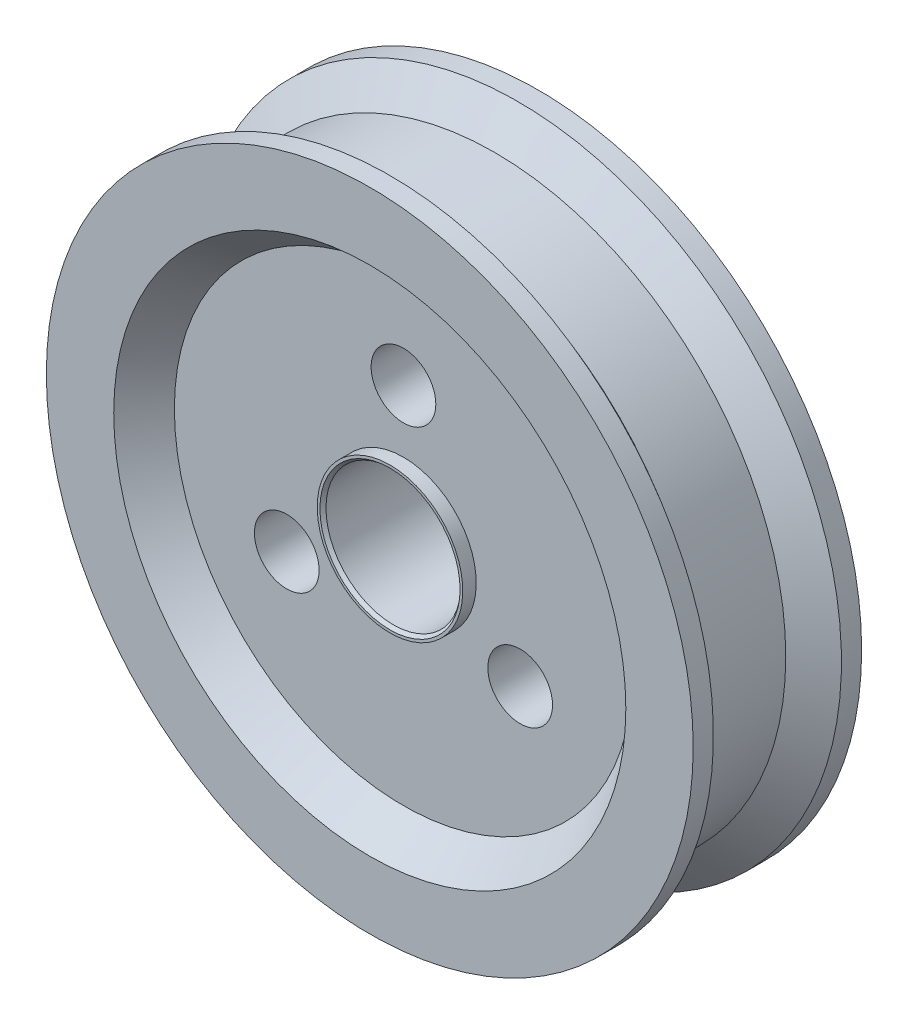
ISO-10303-21;
HEADER;
FILE_DESCRIPTION(('STEP AP214'),'2;1');
FILE_NAME('part.step','',(''),(''),'','','');
FILE_SCHEMA(('AUTOMOTIVE_DESIGN { 1 0 10303 214 1 1 1 1 }'));
ENDSEC;
DATA;
#1=APPLICATION_CONTEXT('core data for automotive mechanical design processes');
#2=APPLICATION_PROTOCOL_DEFINITION('international standard','automotive_design',2000,#1);
#3=PRODUCT_CONTEXT('',#1,'mechanical');
#4=PRODUCT('Part','Part','',(#3));
#5=PRODUCT_RELATED_PRODUCT_CATEGORY('part','',(#4));
#6=PRODUCT_DEFINITION_FORMATION('','',#4);
#7=PRODUCT_DEFINITION_CONTEXT('part definition',#1,'design');
#8=PRODUCT_DEFINITION('design','',#6,#7);
#9=PRODUCT_DEFINITION_SHAPE('','',#8);
#10=(LENGTH_UNIT() NAMED_UNIT(*) SI_UNIT(.MILLI.,.METRE.));
#11=(NAMED_UNIT(*) PLANE_ANGLE_UNIT() SI_UNIT($,.RADIAN.));
#12=(NAMED_UNIT(*) SI_UNIT($,.STERADIAN.) SOLID_ANGLE_UNIT());
#13=UNCERTAINTY_MEASURE_WITH_UNIT(LENGTH_MEASURE(1.E-05),#10,'distance_accuracy_value','');
#14=(GEOMETRIC_REPRESENTATION_CONTEXT(3) GLOBAL_UNCERTAINTY_ASSIGNED_CONTEXT((#13)) GLOBAL_UNIT_ASSIGNED_CONTEXT((#10,
#11,#12)) REPRESENTATION_CONTEXT('',''));
#15=CARTESIAN_POINT('',(0.,0.,0.));
#16=DIRECTION('',(0.,0.,1.));
#17=DIRECTION('',(1.,0.,0.));
#18=AXIS2_PLACEMENT_3D('',#15,#16,#17);
#19=CARTESIAN_POINT('',(0.,0.,9.8950000002415));
#20=DIRECTION('',(0.,0.,-1.));
#21=DIRECTION('',(-1.,0.,0.));
#22=AXIS2_PLACEMENT_3D('',#19,#20,#21);
#23=CYLINDRICAL_SURFACE('',#22,37.9992);
#24=CARTESIAN_POINT('',(0.,0.,-9.8950000002415));
#25=DIRECTION('',(0.,0.,1.));
#26=DIRECTION('',(1.,0.,0.));
#27=AXIS2_PLACEMENT_3D('',#24,#25,#26);
#28=CIRCLE('',#27,37.9992);
#29=CARTESIAN_POINT('',(37.9992,0.,-9.8950000002415));
#30=VERTEX_POINT('',#29);
#31=EDGE_CURVE('E88',#30,#30,#28,.T.);
#32=ORIENTED_EDGE('',*,*,#31,.T.);
#33=EDGE_LOOP('',(#32));
#34=FACE_BOUND('',#33,.T.);
#35=CARTESIAN_POINT('',(0.,0.,-7.52020000018356));
#36=DIRECTION('',(0.,0.,-1.));
#37=DIRECTION('',(-1.,0.,0.));
#38=AXIS2_PLACEMENT_3D('',#35,#36,#37);
#39=CIRCLE('',#38,37.9992);
#40=CARTESIAN_POINT('',(-37.9992,0.,-7.52020000018356));
#41=VERTEX_POINT('',#40);
#42=EDGE_CURVE('E99',#41,#41,#39,.T.);
#43=ORIENTED_EDGE('',*,*,#42,.T.);
#44=EDGE_LOOP('',(#43));
#45=FACE_BOUND('',#44,.T.);
#46=ADVANCED_FACE('F45',(#34,#45),#23,.T.);
#47=CARTESIAN_POINT('',(0.,0.,9.8950000002415));
#48=DIRECTION('',(0.,0.,1.));
#49=DIRECTION('',(1.,0.,0.));
#50=AXIS2_PLACEMENT_3D('',#47,#48,#49);
#51=CIRCLE('',#50,37.9992);
#52=CARTESIAN_POINT('',(37.9992,0.,9.8950000002415));
#53=VERTEX_POINT('',#52);
#54=EDGE_CURVE('E83',#53,#53,#51,.T.);
#55=ORIENTED_EDGE('',*,*,#54,.F.);
#56=EDGE_LOOP('',(#55));
#57=FACE_BOUND('',#56,.T.);
#58=CARTESIAN_POINT('',(0.,0.,7.52020000018354));
#59=DIRECTION('',(0.,0.,-1.));
#60=DIRECTION('',(-1.,0.,0.));
#61=AXIS2_PLACEMENT_3D('',#58,#59,#60);
#62=CIRCLE('',#61,37.9992);
#63=CARTESIAN_POINT('',(-37.9992,0.,7.52020000018354));
#64=VERTEX_POINT('',#63);
#65=EDGE_CURVE('E89',#64,#64,#62,.T.);
#66=ORIENTED_EDGE('',*,*,#65,.F.);
#67=EDGE_LOOP('',(#66));
#68=FACE_BOUND('',#67,.T.);
#69=ADVANCED_FACE('F168',(#57,#68),#23,.T.);
#70=CARTESIAN_POINT('',(0.,0.,9.8950000002415));
#71=DIRECTION('',(0.,0.,1.));
#72=DIRECTION('',(1.,0.,0.));
#73=AXIS2_PLACEMENT_3D('',#70,#71,#72);
#74=PLANE('',#73);
#75=CARTESIAN_POINT('',(0.,0.,9.8950000002415));
#76=DIRECTION('',(0.,0.,-1.));
#77=DIRECTION('',(-1.,0.,0.));
#78=AXIS2_PLACEMENT_3D('',#75,#76,#77);
#79=CIRCLE('',#78,30.0827);
#80=CARTESIAN_POINT('',(-30.0827,0.,9.8950000002415));
#81=VERTEX_POINT('',#80);
#82=EDGE_CURVE('E78',#81,#81,#79,.T.);
#83=ORIENTED_EDGE('',*,*,#82,.T.);
#84=EDGE_LOOP('',(#83));
#85=FACE_BOUND('',#84,.T.);
#86=ORIENTED_EDGE('',*,*,#54,.T.);
#87=EDGE_LOOP('',(#86));
#88=FACE_BOUND('',#87,.T.);
#89=ADVANCED_FACE('F158',(#85,#88),#74,.T.);
#90=CARTESIAN_POINT('',(0.,0.,-9.8950000002415));
#91=DIRECTION('',(0.,0.,1.));
#92=DIRECTION('',(1.,0.,0.));
#93=AXIS2_PLACEMENT_3D('',#90,#91,#92);
#94=PLANE('',#93);
#95=CARTESIAN_POINT('',(0.,0.,-9.8950000002415));
#96=DIRECTION('',(0.,0.,1.));
#97=DIRECTION('',(1.,0.,0.));
#98=AXIS2_PLACEMENT_3D('',#95,#96,#97);
#99=CIRCLE('',#98,30.0827);
#100=CARTESIAN_POINT('',(30.0827,0.,-9.8950000002415));
#101=VERTEX_POINT('',#100);
#102=EDGE_CURVE('E70',#101,#101,#99,.T.);
#103=ORIENTED_EDGE('',*,*,#102,.T.);
#104=EDGE_LOOP('',(#103));
#105=FACE_BOUND('',#104,.T.);
#106=ORIENTED_EDGE('',*,*,#31,.F.);
#107=EDGE_LOOP('',(#106));
#108=FACE_BOUND('',#107,.T.);
#109=ADVANCED_FACE('F155',(#105,#108),#94,.F.);
#110=CARTESIAN_POINT('',(0.,0.,5.9370000001449));
#111=DIRECTION('',(0.,0.,1.));
#112=DIRECTION('',(1.,0.,0.));
#113=AXIS2_PLACEMENT_3D('',#110,#111,#112);
#114=PLANE('',#113);
#115=CARTESIAN_POINT('',(0.,0.,5.9370000001449));
#116=DIRECTION('',(0.,0.,1.));
#117=DIRECTION('',(1.,0.,0.));
#118=AXIS2_PLACEMENT_3D('',#115,#116,#117);
#119=CIRCLE('',#118,8.54982);
#120=CARTESIAN_POINT('',(0.,8.54982,5.9370000001449));
#121=VERTEX_POINT('',#120);
#122=EDGE_CURVE('E82',#121,#121,#119,.T.);
#123=ORIENTED_EDGE('',*,*,#122,.F.);
#124=EDGE_LOOP('',(#123));
#125=FACE_BOUND('',#124,.T.);
#126=CARTESIAN_POINT('',(0.,15.833,5.9370000001449));
#127=DIRECTION('',(0.,0.,1.));
#128=DIRECTION('',(1.,0.,0.));
#129=AXIS2_PLACEMENT_3D('',#126,#127,#128);
#130=CIRCLE('',#129,3.79992);
#131=CARTESIAN_POINT('',(3.79992,15.833,5.9370000001449));
#132=VERTEX_POINT('',#131);
#133=EDGE_CURVE('E136',#132,#132,#130,.T.);
#134=ORIENTED_EDGE('',*,*,#133,.F.);
#135=EDGE_LOOP('',(#134));
#136=FACE_BOUND('',#135,.T.);
#137=CARTESIAN_POINT('',(13.711780218119,-7.91649999999903,5.9370000001449));
#138=DIRECTION('',(0.,0.,1.));
#139=DIRECTION('',(1.,0.,0.));
#140=AXIS2_PLACEMENT_3D('',#137,#138,#139);
#141=CIRCLE('',#140,3.79992000000102);
#142=CARTESIAN_POINT('',(17.51170021812,-7.91649999999903,5.9370000001449));
#143=VERTEX_POINT('',#142);
#144=EDGE_CURVE('E110',#143,#143,#141,.T.);
#145=ORIENTED_EDGE('',*,*,#144,.F.);
#146=EDGE_LOOP('',(#145));
#147=FACE_BOUND('',#146,.T.);
#148=CARTESIAN_POINT('',(-13.7117802181182,-7.91649999999951,5.9370000001449));
#149=DIRECTION('',(0.,0.,1.));
#150=DIRECTION('',(1.,0.,0.));
#151=AXIS2_PLACEMENT_3D('',#148,#149,#150);
#152=CIRCLE('',#151,3.79992000000043);
#153=CARTESIAN_POINT('',(-9.91186021811775,-7.91649999999951,5.9370000001449));
#154=VERTEX_POINT('',#153);
#155=EDGE_CURVE('E104',#154,#154,#152,.T.);
#156=ORIENTED_EDGE('',*,*,#155,.F.);
#157=EDGE_LOOP('',(#156));
#158=FACE_BOUND('',#157,.T.);
#159=CARTESIAN_POINT('',(0.,0.,5.9370000001449));
#160=DIRECTION('',(0.,0.,1.));
#161=DIRECTION('',(1.,0.,0.));
#162=AXIS2_PLACEMENT_3D('',#159,#160,#161);
#163=CIRCLE('',#162,26.9161);
#164=CARTESIAN_POINT('',(26.9161,0.,5.9370000001449));
#165=VERTEX_POINT('',#164);
#166=EDGE_CURVE('E121',#165,#165,#163,.T.);
#167=ORIENTED_EDGE('',*,*,#166,.T.);
#168=EDGE_LOOP('',(#167));
#169=FACE_BOUND('',#168,.T.);
#170=ADVANCED_FACE('F157',(#125,#136,#147,#158,#169),#114,.T.);
#171=CARTESIAN_POINT('',(0.,0.,-5.9370000001449));
#172=DIRECTION('',(0.,0.,-1.));
#173=DIRECTION('',(1.,0.,0.));
#174=AXIS2_PLACEMENT_3D('',#171,#172,#173);
#175=PLANE('',#174);
#176=CARTESIAN_POINT('',(0.,0.,-5.9370000001449));
#177=DIRECTION('',(0.,0.,-1.));
#178=DIRECTION('',(-1.,0.,0.));
#179=AXIS2_PLACEMENT_3D('',#176,#177,#178);
#180=CIRCLE('',#179,8.54982);
#181=CARTESIAN_POINT('',(0.,8.54982,-5.9370000001449));
#182=VERTEX_POINT('',#181);
#183=EDGE_CURVE('E87',#182,#182,#180,.T.);
#184=ORIENTED_EDGE('',*,*,#183,.F.);
#185=EDGE_LOOP('',(#184));
#186=FACE_BOUND('',#185,.T.);
#187=CARTESIAN_POINT('',(0.,15.833,-5.9370000001449));
#188=DIRECTION('',(0.,0.,-1.));
#189=DIRECTION('',(-1.,0.,0.));
#190=AXIS2_PLACEMENT_3D('',#187,#188,#189);
#191=CIRCLE('',#190,3.79992);
#192=CARTESIAN_POINT('',(3.79992,15.833,-5.9370000001449));
#193=VERTEX_POINT('',#192);
#194=EDGE_CURVE('E122',#193,#193,#191,.T.);
#195=ORIENTED_EDGE('',*,*,#194,.F.);
#196=EDGE_LOOP('',(#195));
#197=FACE_BOUND('',#196,.T.);
#198=CARTESIAN_POINT('',(13.711780218119,-7.91649999999903,-5.9370000001449));
#199=DIRECTION('',(0.,0.,-1.));
#200=DIRECTION('',(-1.,0.,0.));
#201=AXIS2_PLACEMENT_3D('',#198,#199,#200);
#202=CIRCLE('',#201,3.79992000000102);
#203=CARTESIAN_POINT('',(17.51170021812,-7.91649999999903,-5.9370000001449));
#204=VERTEX_POINT('',#203);
#205=EDGE_CURVE('E129',#204,#204,#202,.T.);
#206=ORIENTED_EDGE('',*,*,#205,.F.);
#207=EDGE_LOOP('',(#206));
#208=FACE_BOUND('',#207,.T.);
#209=CARTESIAN_POINT('',(-13.7117802181182,-7.91649999999951,-5.9370000001449));
#210=DIRECTION('',(0.,0.,-1.));
#211=DIRECTION('',(-1.,0.,0.));
#212=AXIS2_PLACEMENT_3D('',#209,#210,#211);
#213=CIRCLE('',#212,3.79992000000043);
#214=CARTESIAN_POINT('',(-17.5117002181186,-7.91649999999951,-5.9370000001449));
#215=VERTEX_POINT('',#214);
#216=EDGE_CURVE('E133',#215,#215,#213,.T.);
#217=ORIENTED_EDGE('',*,*,#216,.F.);
#218=EDGE_LOOP('',(#217));
#219=FACE_BOUND('',#218,.T.);
#220=CARTESIAN_POINT('',(0.,0.,-5.9370000001449));
#221=DIRECTION('',(0.,0.,1.));
#222=DIRECTION('',(1.,0.,0.));
#223=AXIS2_PLACEMENT_3D('',#220,#221,#222);
#224=CIRCLE('',#223,26.9161);
#225=CARTESIAN_POINT('',(26.9161,0.,-5.9370000001449));
#226=VERTEX_POINT('',#225);
#227=EDGE_CURVE('E117',#226,#226,#224,.T.);
#228=ORIENTED_EDGE('',*,*,#227,.F.);
#229=EDGE_LOOP('',(#228));
#230=FACE_BOUND('',#229,.T.);
#231=ADVANCED_FACE('F165',(#186,#197,#208,#219,#230),#175,.T.);
#232=CARTESIAN_POINT('',(-13.7117802181182,-7.91649999999951,-9.8950000002415));
#233=DIRECTION('',(0.,0.,1.));
#234=DIRECTION('',(1.,0.,0.));
#235=AXIS2_PLACEMENT_3D('',#232,#233,#234);
#236=CYLINDRICAL_SURFACE('',#235,3.79992000000043);
#237=ORIENTED_EDGE('',*,*,#216,.T.);
#238=EDGE_LOOP('',(#237));
#239=FACE_BOUND('',#238,.T.);
#240=ORIENTED_EDGE('',*,*,#155,.T.);
#241=EDGE_LOOP('',(#240));
#242=FACE_BOUND('',#241,.T.);
#243=ADVANCED_FACE('F324',(#239,#242),#236,.F.);
#244=CARTESIAN_POINT('',(13.711780218119,-7.91649999999903,-9.8950000002415));
#245=DIRECTION('',(0.,0.,1.));
#246=DIRECTION('',(1.,0.,0.));
#247=AXIS2_PLACEMENT_3D('',#244,#245,#246);
#248=CYLINDRICAL_SURFACE('',#247,3.79992000000102);
#249=CARTESIAN_POINT('',(17.51170021812,-7.91649999999903,-5.9370000001449));
#250=CARTESIAN_POINT('',(17.51170021812,-7.91649999999903,-5.81331250014188));
#251=CARTESIAN_POINT('',(17.51170021812,-7.91649999999903,-5.68962500013886));
#252=CARTESIAN_POINT('',(17.51170021812,-7.91649999999903,-5.44225000013282));
#253=CARTESIAN_POINT('',(17.51170021812,-7.91649999999903,-5.31856250012981));
#254=CARTESIAN_POINT('',(17.51170021812,-7.91649999999903,-5.07118750012377));
#255=CARTESIAN_POINT('',(17.51170021812,-7.91649999999903,-4.94750000012075));
#256=CARTESIAN_POINT('',(17.51170021812,-7.91649999999903,-4.70012500011471));
#257=CARTESIAN_POINT('',(17.51170021812,-7.91649999999903,-4.57643750011169));
#258=CARTESIAN_POINT('',(17.51170021812,-7.91649999999903,-4.32906250010566));
#259=CARTESIAN_POINT('',(17.51170021812,-7.91649999999903,-4.20537500010264));
#260=CARTESIAN_POINT('',(17.51170021812,-7.91649999999903,-3.9580000000966));
#261=CARTESIAN_POINT('',(17.51170021812,-7.91649999999903,-3.83431250009358));
#262=CARTESIAN_POINT('',(17.51170021812,-7.91649999999903,-3.58693750008754));
#263=CARTESIAN_POINT('',(17.51170021812,-7.91649999999903,-3.46325000008452));
#264=CARTESIAN_POINT('',(17.51170021812,-7.91649999999903,-3.21587500007849));
#265=CARTESIAN_POINT('',(17.51170021812,-7.91649999999903,-3.09218750007547));
#266=CARTESIAN_POINT('',(17.51170021812,-7.91649999999903,-2.84481250006943));
#267=CARTESIAN_POINT('',(17.51170021812,-7.91649999999903,-2.72112500006641));
#268=CARTESIAN_POINT('',(17.51170021812,-7.91649999999903,-2.47375000006037));
#269=CARTESIAN_POINT('',(17.51170021812,-7.91649999999903,-2.35006250005736));
#270=CARTESIAN_POINT('',(17.51170021812,-7.91649999999903,-2.10268750005132));
#271=CARTESIAN_POINT('',(17.51170021812,-7.91649999999903,-1.9790000000483));
#272=CARTESIAN_POINT('',(17.51170021812,-7.91649999999903,-1.73162500004226));
#273=CARTESIAN_POINT('',(17.51170021812,-7.91649999999903,-1.60793750003924));
#274=CARTESIAN_POINT('',(17.51170021812,-7.91649999999903,-1.36056250003321));
#275=CARTESIAN_POINT('',(17.51170021812,-7.91649999999903,-1.23687500003019));
#276=CARTESIAN_POINT('',(17.51170021812,-7.91649999999903,-0.98950000002415));
#277=CARTESIAN_POINT('',(17.51170021812,-7.91649999999903,-0.865812500021131));
#278=CARTESIAN_POINT('',(17.51170021812,-7.91649999999903,-0.618437500015093));
#279=CARTESIAN_POINT('',(17.51170021812,-7.91649999999903,-0.494750000012074));
#280=CARTESIAN_POINT('',(17.51170021812,-7.91649999999903,-0.247375000006037));
#281=CARTESIAN_POINT('',(17.51170021812,-7.91649999999903,-0.123687500003018));
#282=CARTESIAN_POINT('',(17.51170021812,-7.91649999999903,0.123687500003018));
#283=CARTESIAN_POINT('',(17.51170021812,-7.91649999999903,0.247375000006037));
#284=CARTESIAN_POINT('',(17.51170021812,-7.91649999999903,0.494750000012074));
#285=CARTESIAN_POINT('',(17.51170021812,-7.91649999999903,0.618437500015093));
#286=CARTESIAN_POINT('',(17.51170021812,-7.91649999999903,0.865812500021131));
#287=CARTESIAN_POINT('',(17.51170021812,-7.91649999999903,0.98950000002415));
#288=CARTESIAN_POINT('',(17.51170021812,-7.91649999999903,1.23687500003019));
#289=CARTESIAN_POINT('',(17.51170021812,-7.91649999999903,1.36056250003321));
#290=CARTESIAN_POINT('',(17.51170021812,-7.91649999999903,1.60793750003924));
#291=CARTESIAN_POINT('',(17.51170021812,-7.91649999999903,1.73162500004226));
#292=CARTESIAN_POINT('',(17.51170021812,-7.91649999999903,1.9790000000483));
#293=CARTESIAN_POINT('',(17.51170021812,-7.91649999999903,2.10268750005132));
#294=CARTESIAN_POINT('',(17.51170021812,-7.91649999999903,2.35006250005736));
#295=CARTESIAN_POINT('',(17.51170021812,-7.91649999999903,2.47375000006038));
#296=CARTESIAN_POINT('',(17.51170021812,-7.91649999999903,2.72112500006641));
#297=CARTESIAN_POINT('',(17.51170021812,-7.91649999999903,2.84481250006943));
#298=CARTESIAN_POINT('',(17.51170021812,-7.91649999999903,3.09218750007547));
#299=CARTESIAN_POINT('',(17.51170021812,-7.91649999999903,3.21587500007849));
#300=CARTESIAN_POINT('',(17.51170021812,-7.91649999999903,3.46325000008453));
#301=CARTESIAN_POINT('',(17.51170021812,-7.91649999999903,3.58693750008754));
#302=CARTESIAN_POINT('',(17.51170021812,-7.91649999999903,3.83431250009358));
#303=CARTESIAN_POINT('',(17.51170021812,-7.91649999999903,3.9580000000966));
#304=CARTESIAN_POINT('',(17.51170021812,-7.91649999999903,4.20537500010264));
#305=CARTESIAN_POINT('',(17.51170021812,-7.91649999999903,4.32906250010566));
#306=CARTESIAN_POINT('',(17.51170021812,-7.91649999999903,4.57643750011169));
#307=CARTESIAN_POINT('',(17.51170021812,-7.91649999999903,4.70012500011471));
#308=CARTESIAN_POINT('',(17.51170021812,-7.91649999999903,4.94750000012075));
#309=CARTESIAN_POINT('',(17.51170021812,-7.91649999999903,5.07118750012377));
#310=CARTESIAN_POINT('',(17.51170021812,-7.91649999999903,5.31856250012981));
#311=CARTESIAN_POINT('',(17.51170021812,-7.91649999999903,5.44225000013283));
#312=CARTESIAN_POINT('',(17.51170021812,-7.91649999999903,5.68962500013886));
#313=CARTESIAN_POINT('',(17.51170021812,-7.91649999999903,5.81331250014188));
#314=CARTESIAN_POINT('',(17.51170021812,-7.91649999999903,5.9370000001449));
#315=B_SPLINE_CURVE_WITH_KNOTS('',3,(#249,#250,#251,#252,#253,#254,#255,#256,#257,#258,#259,
#260,#261,#262,#263,#264,#265,#266,#267,#268,#269,#270,#271,#272,#273,#274,#275,#276,#277,#278,
#279,#280,#281,#282,#283,#284,#285,#286,#287,#288,#289,#290,#291,#292,#293,#294,#295,#296,#297,
#298,#299,#300,#301,#302,#303,#304,#305,#306,#307,#308,#309,#310,#311,#312,#313,#314),
.UNSPECIFIED.,.F.,.F.,(4,2,2,2,2,2,2,2,2,2,2,2,2,2,2,2,2,2,2,2,2,2,2,2,2,2,2,2,2,2,2,2,4),(0.,
0.371062500009056,0.742125000018113,1.11318750002717,1.48425000003623,1.85531250004528,
2.22637500005434,2.59743750006339,2.96850000007245,3.33956250008151,3.71062500009056,
4.08168750009962,4.45275000010867,4.82381250011773,5.19487500012679,5.56593750013584,
5.9370000001449,6.30806250015396,6.67912500016301,7.05018750017207,7.42125000018113,
7.79231250019018,8.16337500019924,8.53443750020829,8.90550000021735,9.27656250022641,
9.64762500023546,10.0186875002445,10.3897500002536,10.7608125002626,11.1318750002717,
11.5029375002807,11.8740000002898),.UNSPECIFIED.);
#316=EDGE_CURVE('BSEAM313',#204,#143,#315,.T.);
#317=ORIENTED_EDGE('',*,*,#205,.T.);
#318=ORIENTED_EDGE('',*,*,#144,.T.);
#319=ORIENTED_EDGE('',*,*,#316,.T.);
#320=ORIENTED_EDGE('',*,*,#316,.F.);
#321=EDGE_LOOP('',(#317,#319,#318,#320));
#322=FACE_BOUND('',#321,.T.);
#323=ADVANCED_FACE('F313',(#322),#248,.F.);
#324=CARTESIAN_POINT('',(0.,15.833,-9.8950000002415));
#325=DIRECTION('',(0.,0.,1.));
#326=DIRECTION('',(1.,0.,0.));
#327=AXIS2_PLACEMENT_3D('',#324,#325,#326);
#328=CYLINDRICAL_SURFACE('',#327,3.79992);
#329=CARTESIAN_POINT('',(3.79992,15.833,-5.9370000001449));
#330=CARTESIAN_POINT('',(3.79992,15.833,-5.81331250014188));
#331=CARTESIAN_POINT('',(3.79992,15.833,-5.68962500013886));
#332=CARTESIAN_POINT('',(3.79992,15.833,-5.44225000013282));
#333=CARTESIAN_POINT('',(3.79992,15.833,-5.31856250012981));
#334=CARTESIAN_POINT('',(3.79992,15.833,-5.07118750012377));
#335=CARTESIAN_POINT('',(3.79992,15.833,-4.94750000012075));
#336=CARTESIAN_POINT('',(3.79992,15.833,-4.70012500011471));
#337=CARTESIAN_POINT('',(3.79992,15.833,-4.57643750011169));
#338=CARTESIAN_POINT('',(3.79992,15.833,-4.32906250010566));
#339=CARTESIAN_POINT('',(3.79992,15.833,-4.20537500010264));
#340=CARTESIAN_POINT('',(3.79992,15.833,-3.9580000000966));
#341=CARTESIAN_POINT('',(3.79992,15.833,-3.83431250009358));
#342=CARTESIAN_POINT('',(3.79992,15.833,-3.58693750008754));
#343=CARTESIAN_POINT('',(3.79992,15.833,-3.46325000008452));
#344=CARTESIAN_POINT('',(3.79992,15.833,-3.21587500007849));
#345=CARTESIAN_POINT('',(3.79992,15.833,-3.09218750007547));
#346=CARTESIAN_POINT('',(3.79992,15.833,-2.84481250006943));
#347=CARTESIAN_POINT('',(3.79992,15.833,-2.72112500006641));
#348=CARTESIAN_POINT('',(3.79992,15.833,-2.47375000006037));
#349=CARTESIAN_POINT('',(3.79992,15.833,-2.35006250005736));
#350=CARTESIAN_POINT('',(3.79992,15.833,-2.10268750005132));
#351=CARTESIAN_POINT('',(3.79992,15.833,-1.9790000000483));
#352=CARTESIAN_POINT('',(3.79992,15.833,-1.73162500004226));
#353=CARTESIAN_POINT('',(3.79992,15.833,-1.60793750003924));
#354=CARTESIAN_POINT('',(3.79992,15.833,-1.36056250003321));
#355=CARTESIAN_POINT('',(3.79992,15.833,-1.23687500003019));
#356=CARTESIAN_POINT('',(3.79992,15.833,-0.98950000002415));
#357=CARTESIAN_POINT('',(3.79992,15.833,-0.865812500021131));
#358=CARTESIAN_POINT('',(3.79992,15.833,-0.618437500015093));
#359=CARTESIAN_POINT('',(3.79992,15.833,-0.494750000012074));
#360=CARTESIAN_POINT('',(3.79992,15.833,-0.247375000006037));
#361=CARTESIAN_POINT('',(3.79992,15.833,-0.123687500003018));
#362=CARTESIAN_POINT('',(3.79992,15.833,0.123687500003018));
#363=CARTESIAN_POINT('',(3.79992,15.833,0.247375000006037));
#364=CARTESIAN_POINT('',(3.79992,15.833,0.494750000012074));
#365=CARTESIAN_POINT('',(3.79992,15.833,0.618437500015093));
#366=CARTESIAN_POINT('',(3.79992,15.833,0.865812500021131));
#367=CARTESIAN_POINT('',(3.79992,15.833,0.98950000002415));
#368=CARTESIAN_POINT('',(3.79992,15.833,1.23687500003019));
#369=CARTESIAN_POINT('',(3.79992,15.833,1.36056250003321));
#370=CARTESIAN_POINT('',(3.79992,15.833,1.60793750003924));
#371=CARTESIAN_POINT('',(3.79992,15.833,1.73162500004226));
#372=CARTESIAN_POINT('',(3.79992,15.833,1.9790000000483));
#373=CARTESIAN_POINT('',(3.79992,15.833,2.10268750005132));
#374=CARTESIAN_POINT('',(3.79992,15.833,2.35006250005736));
#375=CARTESIAN_POINT('',(3.79992,15.833,2.47375000006038));
#376=CARTESIAN_POINT('',(3.79992,15.833,2.72112500006641));
#377=CARTESIAN_POINT('',(3.79992,15.833,2.84481250006943));
#378=CARTESIAN_POINT('',(3.79992,15.833,3.09218750007547));
#379=CARTESIAN_POINT('',(3.79992,15.833,3.21587500007849));
#380=CARTESIAN_POINT('',(3.79992,15.833,3.46325000008453));
#381=CARTESIAN_POINT('',(3.79992,15.833,3.58693750008754));
#382=CARTESIAN_POINT('',(3.79992,15.833,3.83431250009358));
#383=CARTESIAN_POINT('',(3.79992,15.833,3.9580000000966));
#384=CARTESIAN_POINT('',(3.79992,15.833,4.20537500010264));
#385=CARTESIAN_POINT('',(3.79992,15.833,4.32906250010566));
#386=CARTESIAN_POINT('',(3.79992,15.833,4.57643750011169));
#387=CARTESIAN_POINT('',(3.79992,15.833,4.70012500011471));
#388=CARTESIAN_POINT('',(3.79992,15.833,4.94750000012075));
#389=CARTESIAN_POINT('',(3.79992,15.833,5.07118750012377));
#390=CARTESIAN_POINT('',(3.79992,15.833,5.31856250012981));
#391=CARTESIAN_POINT('',(3.79992,15.833,5.44225000013283));
#392=CARTESIAN_POINT('',(3.79992,15.833,5.68962500013886));
#393=CARTESIAN_POINT('',(3.79992,15.833,5.81331250014188));
#394=CARTESIAN_POINT('',(3.79992,15.833,5.9370000001449));
#395=B_SPLINE_CURVE_WITH_KNOTS('',3,(#329,#330,#331,#332,#333,#334,#335,#336,#337,#338,#339,
#340,#341,#342,#343,#344,#345,#346,#347,#348,#349,#350,#351,#352,#353,#354,#355,#356,#357,#358,
#359,#360,#361,#362,#363,#364,#365,#366,#367,#368,#369,#370,#371,#372,#373,#374,#375,#376,#377,
#378,#379,#380,#381,#382,#383,#384,#385,#386,#387,#388,#389,#390,#391,#392,#393,#394),
.UNSPECIFIED.,.F.,.F.,(4,2,2,2,2,2,2,2,2,2,2,2,2,2,2,2,2,2,2,2,2,2,2,2,2,2,2,2,2,2,2,2,4),(0.,
0.371062500009056,0.742125000018113,1.11318750002717,1.48425000003623,1.85531250004528,
2.22637500005434,2.59743750006339,2.96850000007245,3.33956250008151,3.71062500009056,
4.08168750009962,4.45275000010867,4.82381250011773,5.19487500012679,5.56593750013584,
5.9370000001449,6.30806250015396,6.67912500016301,7.05018750017207,7.42125000018113,
7.79231250019018,8.16337500019924,8.53443750020829,8.90550000021735,9.27656250022641,
9.64762500023546,10.0186875002445,10.3897500002536,10.7608125002626,11.1318750002717,
11.5029375002807,11.8740000002898),.UNSPECIFIED.);
#396=EDGE_CURVE('BSEAM304',#193,#132,#395,.T.);
#397=ORIENTED_EDGE('',*,*,#194,.T.);
#398=ORIENTED_EDGE('',*,*,#133,.T.);
#399=ORIENTED_EDGE('',*,*,#396,.T.);
#400=ORIENTED_EDGE('',*,*,#396,.F.);
#401=EDGE_LOOP('',(#397,#399,#398,#400));
#402=FACE_BOUND('',#401,.T.);
#403=ADVANCED_FACE('F304',(#402),#328,.F.);
#404=CARTESIAN_POINT('',(0.,0.,-7.52020000018356));
#405=DIRECTION('',(0.,0.,-1.));
#406=DIRECTION('',(-1.,0.,0.));
#407=AXIS2_PLACEMENT_3D('',#404,#405,#406);
#408=CONICAL_SURFACE('',#407,37.9992,0.945692546247486);
#409=CARTESIAN_POINT('',(0.,0.,-4.77801716157356));
#410=DIRECTION('',(0.,0.,-1.));
#411=DIRECTION('',(-1.,0.,0.));
#412=AXIS2_PLACEMENT_3D('',#409,#410,#411);
#413=CIRCLE('',#412,34.19928);
#414=CARTESIAN_POINT('',(-34.19928,0.,-4.77801716157356));
#415=VERTEX_POINT('',#414);
#416=EDGE_CURVE('E49',#415,#415,#413,.T.);
#417=ORIENTED_EDGE('',*,*,#416,.T.);
#418=EDGE_LOOP('',(#417));
#419=FACE_BOUND('',#418,.T.);
#420=ORIENTED_EDGE('',*,*,#42,.F.);
#421=EDGE_LOOP('',(#420));
#422=FACE_BOUND('',#421,.T.);
#423=ADVANCED_FACE('F197',(#419,#422),#408,.T.);
#424=CARTESIAN_POINT('',(0.,0.,-9.8950000002415));
#425=DIRECTION('',(0.,0.,-1.));
#426=DIRECTION('',(-1.,0.,0.));
#427=AXIS2_PLACEMENT_3D('',#424,#425,#426);
#428=CYLINDRICAL_SURFACE('',#427,34.19928);
#429=CARTESIAN_POINT('',(0.,0.,4.77801716157354));
#430=DIRECTION('',(0.,0.,-1.));
#431=DIRECTION('',(0.,1.,0.));
#432=AXIS2_PLACEMENT_3D('',#429,#430,#431);
#433=CIRCLE('',#432,34.19928);
#434=CARTESIAN_POINT('',(-34.19928,0.,4.77801716157354));
#435=VERTEX_POINT('',#434);
#436=EDGE_CURVE('E92',#435,#435,#433,.T.);
#437=CARTESIAN_POINT('',(-34.19928,0.,4.77801716157354));
#438=CARTESIAN_POINT('',(-34.19928,0.,4.67847513737409));
#439=CARTESIAN_POINT('',(-34.19928,0.,4.57893311317464));
#440=CARTESIAN_POINT('',(-34.19928,0.,4.37984906477574));
#441=CARTESIAN_POINT('',(-34.19928,0.,4.28030704057629));
#442=CARTESIAN_POINT('',(-34.19928,0.,4.0812229921774));
#443=CARTESIAN_POINT('',(-34.19928,0.,3.98168096797795));
#444=CARTESIAN_POINT('',(-34.19928,0.,3.78259691957905));
#445=CARTESIAN_POINT('',(-34.19928,0.,3.6830548953796));
#446=CARTESIAN_POINT('',(-34.19928,0.,3.4839708469807));
#447=CARTESIAN_POINT('',(-34.19928,0.,3.38442882278125));
#448=CARTESIAN_POINT('',(-34.19928,0.,3.18534477438236));
#449=CARTESIAN_POINT('',(-34.19928,0.,3.08580275018291));
#450=CARTESIAN_POINT('',(-34.19928,0.,2.88671870178401));
#451=CARTESIAN_POINT('',(-34.19928,0.,2.78717667758456));
#452=CARTESIAN_POINT('',(-34.19928,0.,2.58809262918566));
#453=CARTESIAN_POINT('',(-34.19928,0.,2.48855060498621));
#454=CARTESIAN_POINT('',(-34.19928,0.,2.28946655658731));
#455=CARTESIAN_POINT('',(-34.19928,0.,2.18992453238787));
#456=CARTESIAN_POINT('',(-34.19928,0.,1.99084048398897));
#457=CARTESIAN_POINT('',(-34.19928,0.,1.89129845978952));
#458=CARTESIAN_POINT('',(-34.19928,0.,1.69221441139062));
#459=CARTESIAN_POINT('',(-34.19928,0.,1.59267238719117));
#460=CARTESIAN_POINT('',(-34.19928,0.,1.39358833879228));
#461=CARTESIAN_POINT('',(-34.19928,0.,1.29404631459283));
#462=CARTESIAN_POINT('',(-34.19928,0.,1.09496226619393));
#463=CARTESIAN_POINT('',(-34.19928,0.,0.99542024199448));
#464=CARTESIAN_POINT('',(-34.19928,0.,0.796336193595582));
#465=CARTESIAN_POINT('',(-34.19928,0.,0.696794169396133));
#466=CARTESIAN_POINT('',(-34.19928,0.,0.497710120997235));
#467=CARTESIAN_POINT('',(-34.19928,0.,0.398168096797786));
#468=CARTESIAN_POINT('',(-34.19928,0.,0.199084048398888));
#469=CARTESIAN_POINT('',(-34.19928,0.,0.0995420241994387));
#470=CARTESIAN_POINT('',(-34.19928,0.,-0.0995420241994589));
#471=CARTESIAN_POINT('',(-34.19928,0.,-0.199084048398907));
#472=CARTESIAN_POINT('',(-34.19928,0.,-0.398168096797805));
#473=CARTESIAN_POINT('',(-34.19928,0.,-0.497710120997254));
#474=CARTESIAN_POINT('',(-34.19928,0.,-0.696794169396152));
#475=CARTESIAN_POINT('',(-34.19928,0.,-0.7963361935956));
#476=CARTESIAN_POINT('',(-34.19928,0.,-0.995420241994498));
#477=CARTESIAN_POINT('',(-34.19928,0.,-1.09496226619395));
#478=CARTESIAN_POINT('',(-34.19928,0.,-1.29404631459284));
#479=CARTESIAN_POINT('',(-34.19928,0.,-1.39358833879229));
#480=CARTESIAN_POINT('',(-34.19928,0.,-1.59267238719119));
#481=CARTESIAN_POINT('',(-34.19928,0.,-1.69221441139064));
#482=CARTESIAN_POINT('',(-34.19928,0.,-1.89129845978954));
#483=CARTESIAN_POINT('',(-34.19928,0.,-1.99084048398899));
#484=CARTESIAN_POINT('',(-34.19928,0.,-2.18992453238788));
#485=CARTESIAN_POINT('',(-34.19928,0.,-2.28946655658733));
#486=CARTESIAN_POINT('',(-34.19928,0.,-2.48855060498623));
#487=CARTESIAN_POINT('',(-34.19928,0.,-2.58809262918568));
#488=CARTESIAN_POINT('',(-34.19928,0.,-2.78717667758458));
#489=CARTESIAN_POINT('',(-34.19928,0.,-2.88671870178403));
#490=CARTESIAN_POINT('',(-34.19928,0.,-3.08580275018292));
#491=CARTESIAN_POINT('',(-34.19928,0.,-3.18534477438237));
#492=CARTESIAN_POINT('',(-34.19928,0.,-3.38442882278127));
#493=CARTESIAN_POINT('',(-34.19928,0.,-3.48397084698072));
#494=CARTESIAN_POINT('',(-34.19928,0.,-3.68305489537962));
#495=CARTESIAN_POINT('',(-34.19928,0.,-3.78259691957907));
#496=CARTESIAN_POINT('',(-34.19928,0.,-3.98168096797797));
#497=CARTESIAN_POINT('',(-34.19928,0.,-4.08122299217741));
#498=CARTESIAN_POINT('',(-34.19928,0.,-4.28030704057631));
#499=CARTESIAN_POINT('',(-34.19928,0.,-4.37984906477576));
#500=CARTESIAN_POINT('',(-34.19928,0.,-4.57893311317466));
#501=CARTESIAN_POINT('',(-34.19928,0.,-4.67847513737411));
#502=CARTESIAN_POINT('',(-34.19928,0.,-4.77801716157356));
#503=B_SPLINE_CURVE_WITH_KNOTS('',3,(#437,#438,#439,#440,#441,#442,#443,#444,#445,#446,#447,
#448,#449,#450,#451,#452,#453,#454,#455,#456,#457,#458,#459,#460,#461,#462,#463,#464,#465,#466,
#467,#468,#469,#470,#471,#472,#473,#474,#475,#476,#477,#478,#479,#480,#481,#482,#483,#484,#485,
#486,#487,#488,#489,#490,#491,#492,#493,#494,#495,#496,#497,#498,#499,#500,#501,#502),
.UNSPECIFIED.,.F.,.F.,(4,2,2,2,2,2,2,2,2,2,2,2,2,2,2,2,2,2,2,2,2,2,2,2,2,2,2,2,2,2,2,2,4),(0.,
0.298626072598347,0.597252145196693,0.89587821779504,1.19450429039339,1.49313036299173,
1.79175643559008,2.09038250818843,2.38900858078677,2.68763465338512,2.98626072598347,
3.28488679858181,3.58351287118016,3.88213894377851,4.18076501637685,4.4793910889752,
4.77801716157355,5.07664323417189,5.37526930677024,5.67389537936859,5.97252145196693,
6.27114752456528,6.56977359716363,6.86839966976197,7.16702574236032,7.46565181495867,
7.76427788755701,8.06290396015536,8.36153003275371,8.66015610535205,8.9587821779504,
9.25740825054875,9.5560343231471),.UNSPECIFIED.);
#504=EDGE_CURVE('BSEAM187',#435,#415,#503,.T.);
#505=ORIENTED_EDGE('',*,*,#436,.T.);
#506=ORIENTED_EDGE('',*,*,#416,.F.);
#507=ORIENTED_EDGE('',*,*,#504,.T.);
#508=ORIENTED_EDGE('',*,*,#504,.F.);
#509=EDGE_LOOP('',(#505,#507,#506,#508));
#510=FACE_BOUND('',#509,.T.);
#511=ADVANCED_FACE('F187',(#510),#428,.T.);
#512=CARTESIAN_POINT('',(0.,0.,7.52020000018353));
#513=DIRECTION('',(0.,0.,1.));
#514=DIRECTION('',(1.,0.,0.));
#515=AXIS2_PLACEMENT_3D('',#512,#513,#514);
#516=CONICAL_SURFACE('',#515,37.9992,0.945692546247486);
#517=ORIENTED_EDGE('',*,*,#65,.T.);
#518=EDGE_LOOP('',(#517));
#519=FACE_BOUND('',#518,.T.);
#520=ORIENTED_EDGE('',*,*,#436,.F.);
#521=EDGE_LOOP('',(#520));
#522=FACE_BOUND('',#521,.T.);
#523=ADVANCED_FACE('F183',(#519,#522),#516,.T.);
#524=CARTESIAN_POINT('',(0.,0.,7.52020000018354));
#525=DIRECTION('',(0.,0.,-1.));
#526=DIRECTION('',(0.,1.,0.));
#527=AXIS2_PLACEMENT_3D('',#524,#525,#526);
#528=CYLINDRICAL_SURFACE('',#527,8.54982);
#529=CARTESIAN_POINT('',(0.,0.,-7.52020000018354));
#530=DIRECTION('',(0.,0.,-1.));
#531=DIRECTION('',(0.,1.,0.));
#532=AXIS2_PLACEMENT_3D('',#529,#530,#531);
#533=CIRCLE('',#532,8.54982);
#534=CARTESIAN_POINT('',(0.,8.54982,-7.52020000018354));
#535=VERTEX_POINT('',#534);
#536=EDGE_CURVE('E74',#535,#535,#533,.T.);
#537=CARTESIAN_POINT('',(0.,8.54982,-5.9370000001449));
#538=CARTESIAN_POINT('',(0.,8.54982,-5.95349166681197));
#539=CARTESIAN_POINT('',(0.,8.54982,-5.96998333347904));
#540=CARTESIAN_POINT('',(0.,8.54982,-6.00296666681318));
#541=CARTESIAN_POINT('',(0.,8.54982,-6.01945833348025));
#542=CARTESIAN_POINT('',(0.,8.54982,-6.05244166681439));
#543=CARTESIAN_POINT('',(0.,8.54982,-6.06893333348145));
#544=CARTESIAN_POINT('',(0.,8.54982,-6.10191666681559));
#545=CARTESIAN_POINT('',(0.,8.54982,-6.11840833348266));
#546=CARTESIAN_POINT('',(0.,8.54982,-6.1513916668168));
#547=CARTESIAN_POINT('',(0.,8.54982,-6.16788333348387));
#548=CARTESIAN_POINT('',(0.,8.54982,-6.20086666681801));
#549=CARTESIAN_POINT('',(0.,8.54982,-6.21735833348508));
#550=CARTESIAN_POINT('',(0.,8.54982,-6.25034166681922));
#551=CARTESIAN_POINT('',(0.,8.54982,-6.26683333348628));
#552=CARTESIAN_POINT('',(0.,8.54982,-6.29981666682042));
#553=CARTESIAN_POINT('',(0.,8.54982,-6.31630833348749));
#554=CARTESIAN_POINT('',(0.,8.54982,-6.34929166682163));
#555=CARTESIAN_POINT('',(0.,8.54982,-6.3657833334887));
#556=CARTESIAN_POINT('',(0.,8.54982,-6.39876666682284));
#557=CARTESIAN_POINT('',(0.,8.54982,-6.41525833348991));
#558=CARTESIAN_POINT('',(0.,8.54982,-6.44824166682404));
#559=CARTESIAN_POINT('',(0.,8.54982,-6.46473333349111));
#560=CARTESIAN_POINT('',(0.,8.54982,-6.49771666682525));
#561=CARTESIAN_POINT('',(0.,8.54982,-6.51420833349232));
#562=CARTESIAN_POINT('',(0.,8.54982,-6.54719166682646));
#563=CARTESIAN_POINT('',(0.,8.54982,-6.56368333349353));
#564=CARTESIAN_POINT('',(0.,8.54982,-6.59666666682767));
#565=CARTESIAN_POINT('',(0.,8.54982,-6.61315833349474));
#566=CARTESIAN_POINT('',(0.,8.54982,-6.64614166682887));
#567=CARTESIAN_POINT('',(0.,8.54982,-6.66263333349594));
#568=CARTESIAN_POINT('',(0.,8.54982,-6.69561666683008));
#569=CARTESIAN_POINT('',(0.,8.54982,-6.71210833349715));
#570=CARTESIAN_POINT('',(0.,8.54982,-6.74509166683129));
#571=CARTESIAN_POINT('',(0.,8.54982,-6.76158333349836));
#572=CARTESIAN_POINT('',(0.,8.54982,-6.7945666668325));
#573=CARTESIAN_POINT('',(0.,8.54982,-6.81105833349957));
#574=CARTESIAN_POINT('',(0.,8.54982,-6.8440416668337));
#575=CARTESIAN_POINT('',(0.,8.54982,-6.86053333350077));
#576=CARTESIAN_POINT('',(0.,8.54982,-6.89351666683491));
#577=CARTESIAN_POINT('',(0.,8.54982,-6.91000833350198));
#578=CARTESIAN_POINT('',(0.,8.54982,-6.94299166683612));
#579=CARTESIAN_POINT('',(0.,8.54982,-6.95948333350319));
#580=CARTESIAN_POINT('',(0.,8.54982,-6.99246666683733));
#581=CARTESIAN_POINT('',(0.,8.54982,-7.0089583335044));
#582=CARTESIAN_POINT('',(0.,8.54982,-7.04194166683853));
#583=CARTESIAN_POINT('',(0.,8.54982,-7.0584333335056));
#584=CARTESIAN_POINT('',(0.,8.54982,-7.09141666683974));
#585=CARTESIAN_POINT('',(0.,8.54982,-7.10790833350681));
#586=CARTESIAN_POINT('',(0.,8.54982,-7.14089166684095));
#587=CARTESIAN_POINT('',(0.,8.54982,-7.15738333350802));
#588=CARTESIAN_POINT('',(0.,8.54982,-7.19036666684216));
#589=CARTESIAN_POINT('',(0.,8.54982,-7.20685833350923));
#590=CARTESIAN_POINT('',(0.,8.54982,-7.23984166684336));
#591=CARTESIAN_POINT('',(0.,8.54982,-7.25633333351043));
#592=CARTESIAN_POINT('',(0.,8.54982,-7.28931666684457));
#593=CARTESIAN_POINT('',(0.,8.54982,-7.30580833351164));
#594=CARTESIAN_POINT('',(0.,8.54982,-7.33879166684578));
#595=CARTESIAN_POINT('',(0.,8.54982,-7.35528333351285));
#596=CARTESIAN_POINT('',(0.,8.54982,-7.38826666684699));
#597=CARTESIAN_POINT('',(0.,8.54982,-7.40475833351406));
#598=CARTESIAN_POINT('',(0.,8.54982,-7.43774166684819));
#599=CARTESIAN_POINT('',(0.,8.54982,-7.45423333351526));
#600=CARTESIAN_POINT('',(0.,8.54982,-7.4872166668494));
#601=CARTESIAN_POINT('',(0.,8.54982,-7.50370833351647));
#602=CARTESIAN_POINT('',(0.,8.54982,-7.52020000018354));
#603=B_SPLINE_CURVE_WITH_KNOTS('',3,(#537,#538,#539,#540,#541,#542,#543,#544,#545,#546,#547,
#548,#549,#550,#551,#552,#553,#554,#555,#556,#557,#558,#559,#560,#561,#562,#563,#564,#565,#566,
#567,#568,#569,#570,#571,#572,#573,#574,#575,#576,#577,#578,#579,#580,#581,#582,#583,#584,#585,
#586,#587,#588,#589,#590,#591,#592,#593,#594,#595,#596,#597,#598,#599,#600,#601,#602),
.UNSPECIFIED.,.F.,.F.,(4,2,2,2,2,2,2,2,2,2,2,2,2,2,2,2,2,2,2,2,2,2,2,2,2,2,2,2,2,2,2,2,4),(0.,
0.0494750000012076,0.0989500000024152,0.148425000003623,0.19790000000483,0.247375000006038,
0.296850000007245,0.346325000008453,0.395800000009661,0.445275000010867,0.494750000012074,
0.544225000013282,0.593700000014489,0.643175000015697,0.692650000016904,0.742125000018112,
0.79160000001932,0.841075000020527,0.890550000021735,0.940025000022942,0.98950000002415,
1.03897500002536,1.08845000002657,1.13792500002777,1.18740000002898,1.23687500003019,
1.28635000003139,1.3358250000326,1.38530000003381,1.43477500003502,1.48425000003622,
1.53372500003743,1.58320000003864),.UNSPECIFIED.);
#604=EDGE_CURVE('BSEAM186',#182,#535,#603,.T.);
#605=ORIENTED_EDGE('',*,*,#183,.T.);
#606=ORIENTED_EDGE('',*,*,#536,.F.);
#607=ORIENTED_EDGE('',*,*,#604,.T.);
#608=ORIENTED_EDGE('',*,*,#604,.F.);
#609=EDGE_LOOP('',(#605,#607,#606,#608));
#610=FACE_BOUND('',#609,.T.);
#611=ADVANCED_FACE('F186',(#610),#528,.T.);
#612=CARTESIAN_POINT('',(0.,0.,-7.52020000018354));
#613=DIRECTION('',(0.,0.,-1.));
#614=DIRECTION('',(-1.,0.,0.));
#615=AXIS2_PLACEMENT_3D('',#612,#613,#614);
#616=PLANE('',#615);
#617=CARTESIAN_POINT('',(0.,0.,-7.52020000018354));
#618=DIRECTION('',(0.,0.,1.));
#619=DIRECTION('',(0.,-1.,0.));
#620=AXIS2_PLACEMENT_3D('',#617,#618,#619);
#621=CIRCLE('',#620,8.23316000000002);
#622=CARTESIAN_POINT('',(0.,-8.23316000000002,-7.52020000018354));
#623=VERTEX_POINT('',#622);
#624=EDGE_CURVE('E54',#623,#623,#621,.T.);
#625=ORIENTED_EDGE('',*,*,#624,.T.);
#626=EDGE_LOOP('',(#625));
#627=FACE_BOUND('',#626,.T.);
#628=ORIENTED_EDGE('',*,*,#536,.T.);
#629=EDGE_LOOP('',(#628));
#630=FACE_BOUND('',#629,.T.);
#631=ADVANCED_FACE('F193',(#627,#630),#616,.T.);
#632=CARTESIAN_POINT('',(0.,0.,7.52020000018354));
#633=DIRECTION('',(0.,0.,-1.));
#634=DIRECTION('',(0.,1.,0.));
#635=AXIS2_PLACEMENT_3D('',#632,#633,#634);
#636=CIRCLE('',#635,8.54982);
#637=CARTESIAN_POINT('',(0.,8.54982,7.52020000018354));
#638=VERTEX_POINT('',#637);
#639=EDGE_CURVE('E64',#638,#638,#636,.T.);
#640=CARTESIAN_POINT('',(0.,8.54982,5.9370000001449));
#641=CARTESIAN_POINT('',(0.,8.54982,5.95349166681197));
#642=CARTESIAN_POINT('',(0.,8.54982,5.96998333347904));
#643=CARTESIAN_POINT('',(0.,8.54982,6.00296666681318));
#644=CARTESIAN_POINT('',(0.,8.54982,6.01945833348025));
#645=CARTESIAN_POINT('',(0.,8.54982,6.05244166681438));
#646=CARTESIAN_POINT('',(0.,8.54982,6.06893333348145));
#647=CARTESIAN_POINT('',(0.,8.54982,6.10191666681559));
#648=CARTESIAN_POINT('',(0.,8.54982,6.11840833348266));
#649=CARTESIAN_POINT('',(0.,8.54982,6.1513916668168));
#650=CARTESIAN_POINT('',(0.,8.54982,6.16788333348387));
#651=CARTESIAN_POINT('',(0.,8.54982,6.20086666681801));
#652=CARTESIAN_POINT('',(0.,8.54982,6.21735833348508));
#653=CARTESIAN_POINT('',(0.,8.54982,6.25034166681921));
#654=CARTESIAN_POINT('',(0.,8.54982,6.26683333348628));
#655=CARTESIAN_POINT('',(0.,8.54982,6.29981666682042));
#656=CARTESIAN_POINT('',(0.,8.54982,6.31630833348749));
#657=CARTESIAN_POINT('',(0.,8.54982,6.34929166682163));
#658=CARTESIAN_POINT('',(0.,8.54982,6.3657833334887));
#659=CARTESIAN_POINT('',(0.,8.54982,6.39876666682284));
#660=CARTESIAN_POINT('',(0.,8.54982,6.41525833348991));
#661=CARTESIAN_POINT('',(0.,8.54982,6.44824166682405));
#662=CARTESIAN_POINT('',(0.,8.54982,6.46473333349111));
#663=CARTESIAN_POINT('',(0.,8.54982,6.49771666682525));
#664=CARTESIAN_POINT('',(0.,8.54982,6.51420833349232));
#665=CARTESIAN_POINT('',(0.,8.54982,6.54719166682646));
#666=CARTESIAN_POINT('',(0.,8.54982,6.56368333349353));
#667=CARTESIAN_POINT('',(0.,8.54982,6.59666666682767));
#668=CARTESIAN_POINT('',(0.,8.54982,6.61315833349474));
#669=CARTESIAN_POINT('',(0.,8.54982,6.64614166682888));
#670=CARTESIAN_POINT('',(0.,8.54982,6.66263333349595));
#671=CARTESIAN_POINT('',(0.,8.54982,6.69561666683008));
#672=CARTESIAN_POINT('',(0.,8.54982,6.71210833349715));
#673=CARTESIAN_POINT('',(0.,8.54982,6.74509166683129));
#674=CARTESIAN_POINT('',(0.,8.54982,6.76158333349836));
#675=CARTESIAN_POINT('',(0.,8.54982,6.7945666668325));
#676=CARTESIAN_POINT('',(0.,8.54982,6.81105833349957));
#677=CARTESIAN_POINT('',(0.,8.54982,6.84404166683371));
#678=CARTESIAN_POINT('',(0.,8.54982,6.86053333350077));
#679=CARTESIAN_POINT('',(0.,8.54982,6.89351666683491));
#680=CARTESIAN_POINT('',(0.,8.54982,6.91000833350198));
#681=CARTESIAN_POINT('',(0.,8.54982,6.94299166683612));
#682=CARTESIAN_POINT('',(0.,8.54982,6.95948333350319));
#683=CARTESIAN_POINT('',(0.,8.54982,6.99246666683733));
#684=CARTESIAN_POINT('',(0.,8.54982,7.0089583335044));
#685=CARTESIAN_POINT('',(0.,8.54982,7.04194166683854));
#686=CARTESIAN_POINT('',(0.,8.54982,7.05843333350561));
#687=CARTESIAN_POINT('',(0.,8.54982,7.09141666683974));
#688=CARTESIAN_POINT('',(0.,8.54982,7.10790833350681));
#689=CARTESIAN_POINT('',(0.,8.54982,7.14089166684095));
#690=CARTESIAN_POINT('',(0.,8.54982,7.15738333350802));
#691=CARTESIAN_POINT('',(0.,8.54982,7.19036666684216));
#692=CARTESIAN_POINT('',(0.,8.54982,7.20685833350923));
#693=CARTESIAN_POINT('',(0.,8.54982,7.23984166684337));
#694=CARTESIAN_POINT('',(0.,8.54982,7.25633333351044));
#695=CARTESIAN_POINT('',(0.,8.54982,7.28931666684457));
#696=CARTESIAN_POINT('',(0.,8.54982,7.30580833351164));
#697=CARTESIAN_POINT('',(0.,8.54982,7.33879166684578));
#698=CARTESIAN_POINT('',(0.,8.54982,7.35528333351285));
#699=CARTESIAN_POINT('',(0.,8.54982,7.38826666684699));
#700=CARTESIAN_POINT('',(0.,8.54982,7.40475833351406));
#701=CARTESIAN_POINT('',(0.,8.54982,7.4377416668482));
#702=CARTESIAN_POINT('',(0.,8.54982,7.45423333351527));
#703=CARTESIAN_POINT('',(0.,8.54982,7.4872166668494));
#704=CARTESIAN_POINT('',(0.,8.54982,7.50370833351647));
#705=CARTESIAN_POINT('',(0.,8.54982,7.52020000018354));
#706=B_SPLINE_CURVE_WITH_KNOTS('',3,(#640,#641,#642,#643,#644,#645,#646,#647,#648,#649,#650,
#651,#652,#653,#654,#655,#656,#657,#658,#659,#660,#661,#662,#663,#664,#665,#666,#667,#668,#669,
#670,#671,#672,#673,#674,#675,#676,#677,#678,#679,#680,#681,#682,#683,#684,#685,#686,#687,#688,
#689,#690,#691,#692,#693,#694,#695,#696,#697,#698,#699,#700,#701,#702,#703,#704,#705),
.UNSPECIFIED.,.F.,.F.,(4,2,2,2,2,2,2,2,2,2,2,2,2,2,2,2,2,2,2,2,2,2,2,2,2,2,2,2,2,2,2,2,4),(0.,
0.0494750000012076,0.0989500000024152,0.148425000003623,0.19790000000483,0.247375000006038,
0.296850000007245,0.346325000008453,0.395800000009661,0.445275000010868,0.494750000012076,
0.544225000013283,0.593700000014491,0.643175000015699,0.692650000016906,0.742125000018114,
0.791600000019321,0.841075000020529,0.890550000021736,0.940025000022944,0.989500000024152,
1.03897500002536,1.08845000002657,1.13792500002777,1.18740000002898,1.23687500003019,
1.2863500000314,1.3358250000326,1.38530000003381,1.43477500003502,1.48425000003623,
1.53372500003743,1.58320000003864),.UNSPECIFIED.);
#707=EDGE_CURVE('BSEAM196',#121,#638,#706,.T.);
#708=ORIENTED_EDGE('',*,*,#122,.T.);
#709=ORIENTED_EDGE('',*,*,#639,.T.);
#710=ORIENTED_EDGE('',*,*,#707,.T.);
#711=ORIENTED_EDGE('',*,*,#707,.F.);
#712=EDGE_LOOP('',(#708,#710,#709,#711));
#713=FACE_BOUND('',#712,.T.);
#714=ADVANCED_FACE('F196',(#713),#528,.T.);
#715=CARTESIAN_POINT('',(0.,0.,7.52020000018354));
#716=DIRECTION('',(0.,0.,-1.));
#717=DIRECTION('',(-1.,0.,0.));
#718=AXIS2_PLACEMENT_3D('',#715,#716,#717);
#719=PLANE('',#718);
#720=CARTESIAN_POINT('',(0.,0.,7.52020000018354));
#721=DIRECTION('',(0.,0.,-1.));
#722=DIRECTION('',(0.,1.,0.));
#723=AXIS2_PLACEMENT_3D('',#720,#721,#722);
#724=CIRCLE('',#723,8.23315999999999);
#725=CARTESIAN_POINT('',(0.,8.23315999999999,7.52020000018354));
#726=VERTEX_POINT('',#725);
#727=EDGE_CURVE('E10',#726,#726,#724,.T.);
#728=ORIENTED_EDGE('',*,*,#727,.T.);
#729=EDGE_LOOP('',(#728));
#730=FACE_BOUND('',#729,.T.);
#731=ORIENTED_EDGE('',*,*,#639,.F.);
#732=EDGE_LOOP('',(#731));
#733=FACE_BOUND('',#732,.T.);
#734=ADVANCED_FACE('F204',(#730,#733),#719,.F.);
#735=CARTESIAN_POINT('',(0.,0.,9.8950000002415));
#736=DIRECTION('',(0.,0.,-1.));
#737=DIRECTION('',(-1.,0.,0.));
#738=AXIS2_PLACEMENT_3D('',#735,#736,#737);
#739=CYLINDRICAL_SURFACE('',#738,7.9165);
#740=CARTESIAN_POINT('',(0.,0.,-7.12440000017386));
#741=DIRECTION('',(0.,0.,-1.));
#742=DIRECTION('',(-1.,0.,0.));
#743=AXIS2_PLACEMENT_3D('',#740,#741,#742);
#744=CIRCLE('',#743,7.9165);
#745=CARTESIAN_POINT('',(-7.9165,0.,-7.12440000017386));
#746=VERTEX_POINT('',#745);
#747=EDGE_CURVE('E60',#746,#746,#744,.T.);
#748=ORIENTED_EDGE('',*,*,#747,.T.);
#749=EDGE_LOOP('',(#748));
#750=FACE_BOUND('',#749,.T.);
#751=CARTESIAN_POINT('',(0.,0.,7.12440000017389));
#752=DIRECTION('',(0.,0.,1.));
#753=DIRECTION('',(0.,-1.,0.));
#754=AXIS2_PLACEMENT_3D('',#751,#752,#753);
#755=CIRCLE('',#754,7.9165);
#756=CARTESIAN_POINT('',(0.,-7.9165,7.12440000017389));
#757=VERTEX_POINT('',#756);
#758=EDGE_CURVE('E66',#757,#757,#755,.T.);
#759=ORIENTED_EDGE('',*,*,#758,.T.);
#760=EDGE_LOOP('',(#759));
#761=FACE_BOUND('',#760,.T.);
#762=ADVANCED_FACE('F207',(#750,#761),#739,.F.);
#763=CARTESIAN_POINT('',(0.,0.,9.8950000002415));
#764=DIRECTION('',(0.,0.,1.));
#765=DIRECTION('',(1.,0.,0.));
#766=AXIS2_PLACEMENT_3D('',#763,#764,#765);
#767=CONICAL_SURFACE('',#766,30.0827,0.674771752775966);
#768=ORIENTED_EDGE('',*,*,#82,.F.);
#769=EDGE_LOOP('',(#768));
#770=FACE_BOUND('',#769,.T.);
#771=ORIENTED_EDGE('',*,*,#166,.F.);
#772=EDGE_LOOP('',(#771));
#773=FACE_BOUND('',#772,.T.);
#774=ADVANCED_FACE('F210',(#770,#773),#767,.F.);
#775=CARTESIAN_POINT('',(0.,0.,-9.8950000002415));
#776=DIRECTION('',(0.,0.,-1.));
#777=DIRECTION('',(-1.,0.,0.));
#778=AXIS2_PLACEMENT_3D('',#775,#776,#777);
#779=CONICAL_SURFACE('',#778,30.0827,0.674771752775966);
#780=ORIENTED_EDGE('',*,*,#102,.F.);
#781=EDGE_LOOP('',(#780));
#782=FACE_BOUND('',#781,.T.);
#783=ORIENTED_EDGE('',*,*,#227,.T.);
#784=EDGE_LOOP('',(#783));
#785=FACE_BOUND('',#784,.T.);
#786=ADVANCED_FACE('F214',(#782,#785),#779,.F.);
#787=CARTESIAN_POINT('',(0.,0.,-7.52020000018354));
#788=DIRECTION('',(0.,0.,-1.));
#789=DIRECTION('',(0.,1.,0.));
#790=AXIS2_PLACEMENT_3D('',#787,#788,#789);
#791=CONICAL_SURFACE('',#790,8.23316000000002,0.674771752775977);
#792=ORIENTED_EDGE('',*,*,#624,.F.);
#793=EDGE_LOOP('',(#792));
#794=FACE_BOUND('',#793,.T.);
#795=ORIENTED_EDGE('',*,*,#747,.F.);
#796=EDGE_LOOP('',(#795));
#797=FACE_BOUND('',#796,.T.);
#798=ADVANCED_FACE('F217',(#794,#797),#791,.F.);
#799=CARTESIAN_POINT('',(0.,0.,7.52020000018354));
#800=DIRECTION('',(0.,0.,1.));
#801=DIRECTION('',(0.,-1.,0.));
#802=AXIS2_PLACEMENT_3D('',#799,#800,#801);
#803=CONICAL_SURFACE('',#802,8.23315999999999,0.674771752775951);
#804=ORIENTED_EDGE('',*,*,#758,.F.);
#805=EDGE_LOOP('',(#804));
#806=FACE_BOUND('',#805,.T.);
#807=ORIENTED_EDGE('',*,*,#727,.F.);
#808=EDGE_LOOP('',(#807));
#809=FACE_BOUND('',#808,.T.);
#810=ADVANCED_FACE('F47',(#806,#809),#803,.F.);
#811=CLOSED_SHELL('',(#46,#69,#89,#109,#170,#231,#243,#323,#403,#423,#511,#523,#611,#631,#714,
#734,#762,#774,#786,#798,#810));
#812=MANIFOLD_SOLID_BREP('B2',#811);
#813=ADVANCED_BREP_SHAPE_REPRESENTATION('',(#18,#812),#14);
#814=SHAPE_DEFINITION_REPRESENTATION(#9,#813);
ENDSEC;
END-ISO-10303-21;
